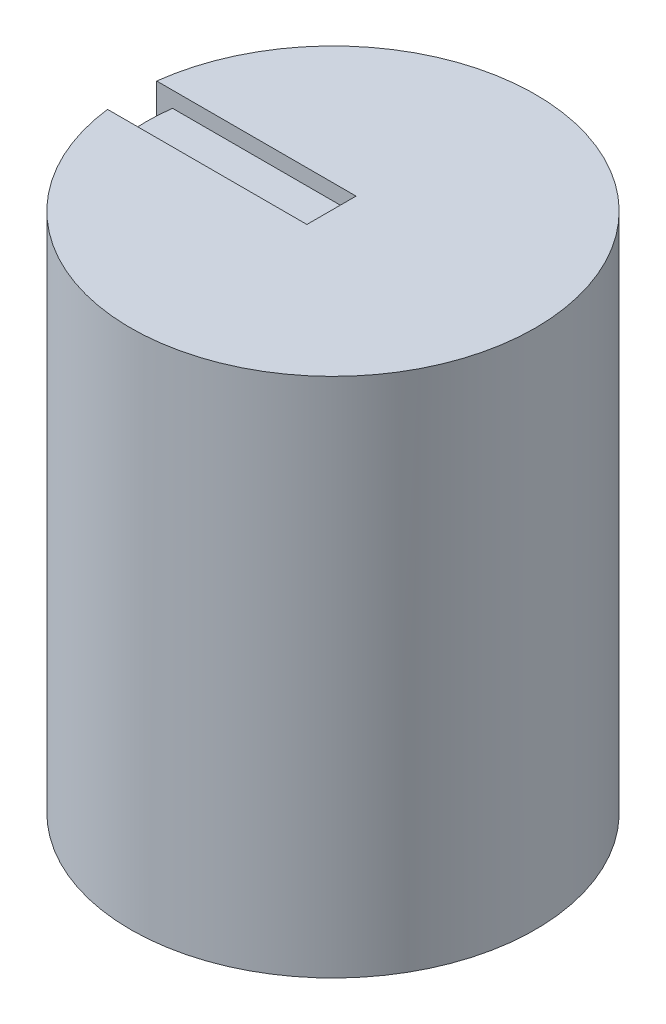
ISO-10303-21;
HEADER;
FILE_DESCRIPTION(('STEP AP214'),'2;1');
FILE_NAME('part.step','',(''),(''),'','','');
FILE_SCHEMA(('AUTOMOTIVE_DESIGN { 1 0 10303 214 1 1 1 1 }'));
ENDSEC;
DATA;
#1=APPLICATION_CONTEXT('core data for automotive mechanical design processes');
#2=APPLICATION_PROTOCOL_DEFINITION('international standard','automotive_design',2000,#1);
#3=PRODUCT_CONTEXT('',#1,'mechanical');
#4=PRODUCT('Part','Part','',(#3));
#5=PRODUCT_RELATED_PRODUCT_CATEGORY('part','',(#4));
#6=PRODUCT_DEFINITION_FORMATION('','',#4);
#7=PRODUCT_DEFINITION_CONTEXT('part definition',#1,'design');
#8=PRODUCT_DEFINITION('design','',#6,#7);
#9=PRODUCT_DEFINITION_SHAPE('','',#8);
#10=(LENGTH_UNIT() NAMED_UNIT(*) SI_UNIT(.MILLI.,.METRE.));
#11=(NAMED_UNIT(*) PLANE_ANGLE_UNIT() SI_UNIT($,.RADIAN.));
#12=(NAMED_UNIT(*) SI_UNIT($,.STERADIAN.) SOLID_ANGLE_UNIT());
#13=UNCERTAINTY_MEASURE_WITH_UNIT(LENGTH_MEASURE(1.E-05),#10,'distance_accuracy_value','');
#14=(GEOMETRIC_REPRESENTATION_CONTEXT(3) GLOBAL_UNCERTAINTY_ASSIGNED_CONTEXT((#13)) GLOBAL_UNIT_ASSIGNED_CONTEXT((#10,
#11,#12)) REPRESENTATION_CONTEXT('',''));
#15=CARTESIAN_POINT('',(0.,0.,0.));
#16=DIRECTION('',(0.,0.,1.));
#17=DIRECTION('',(1.,0.,0.));
#18=AXIS2_PLACEMENT_3D('',#15,#16,#17);
#19=CARTESIAN_POINT('',(0.,16.3322,0.));
#20=DIRECTION('',(0.,1.,0.));
#21=DIRECTION('',(0.,0.,1.));
#22=AXIS2_PLACEMENT_3D('',#19,#20,#21);
#23=PLANE('',#22);
#24=CARTESIAN_POINT('',(0.,16.3322,0.));
#25=DIRECTION('',(0.,-1.,0.));
#26=DIRECTION('',(0.,0.,-1.));
#27=AXIS2_PLACEMENT_3D('',#24,#25,#26);
#28=CIRCLE('',#27,6.0325);
#29=CARTESIAN_POINT('',(-5.98001434417332,16.3322,-0.79403066280931));
#30=VERTEX_POINT('',#29);
#31=CARTESIAN_POINT('',(-5.98001434417332,16.3322,0.794030662809315));
#32=VERTEX_POINT('',#31);
#33=EDGE_CURVE('E120',#30,#32,#28,.F.);
#34=ORIENTED_EDGE('',*,*,#33,.T.);
#35=DIRECTION('',(-1.,0.,0.));
#36=VECTOR('',#35,1.);
#37=CARTESIAN_POINT('',(0.,16.3322,0.794030662809315));
#38=LINE('',#37,#36);
#39=CARTESIAN_POINT('',(-0.0492896040025954,16.3322,0.794030662809315));
#40=VERTEX_POINT('',#39);
#41=EDGE_CURVE('E130',#40,#32,#38,.T.);
#42=ORIENTED_EDGE('',*,*,#41,.F.);
#43=DIRECTION('',(0.,0.,1.));
#44=VECTOR('',#43,1.);
#45=CARTESIAN_POINT('',(-0.0492896040025954,16.3322,0.));
#46=LINE('',#45,#44);
#47=CARTESIAN_POINT('',(-0.0492896040025954,16.3322,-0.79403066280931));
#48=VERTEX_POINT('',#47);
#49=EDGE_CURVE('E137',#48,#40,#46,.T.);
#50=ORIENTED_EDGE('',*,*,#49,.F.);
#51=DIRECTION('',(1.,0.,0.));
#52=VECTOR('',#51,1.);
#53=CARTESIAN_POINT('',(0.,16.3322,-0.79403066280931));
#54=LINE('',#53,#52);
#55=EDGE_CURVE('E131',#30,#48,#54,.T.);
#56=ORIENTED_EDGE('',*,*,#55,.F.);
#57=EDGE_LOOP('',(#34,#42,#50,#56));
#58=FACE_BOUND('',#57,.T.);
#59=ADVANCED_FACE('F37',(#58),#23,.T.);
#60=CARTESIAN_POINT('',(0.,12.573,0.));
#61=DIRECTION('',(0.,-1.,0.));
#62=DIRECTION('',(0.,0.,-1.));
#63=AXIS2_PLACEMENT_3D('',#60,#61,#62);
#64=CYLINDRICAL_SURFACE('',#63,6.5405);
#65=CARTESIAN_POINT('',(0.,29.045499725639,0.));
#66=DIRECTION('',(-0.610334521541643,0.190808995376545,-0.768819679182269));
#67=DIRECTION('',(-0.118637012974686,-0.981627183447664,-0.149443406910611));
#68=AXIS2_PLACEMENT_3D('',#65,#66,#67);
#69=ELLIPSE('',#68,34.2777340611898,6.5405);
#70=CARTESIAN_POINT('',(-6.09641178407993,0.,-2.36894567454204));
#71=VERTEX_POINT('',#70);
#72=CARTESIAN_POINT('',(-6.49212257713289,5.08,-0.794030662809312));
#73=VERTEX_POINT('',#72);
#74=EDGE_CURVE('E173',#71,#73,#69,.T.);
#75=ORIENTED_EDGE('',*,*,#74,.T.);
#76=DIRECTION('',(0.,1.,0.));
#77=VECTOR('',#76,1.);
#78=CARTESIAN_POINT('',(-6.49212257713289,16.3322,-0.79403066280931));
#79=LINE('',#78,#77);
#80=CARTESIAN_POINT('',(-6.49212257713289,16.8402,-0.79403066280931));
#81=VERTEX_POINT('',#80);
#82=EDGE_CURVE('E151',#73,#81,#79,.T.);
#83=ORIENTED_EDGE('',*,*,#82,.T.);
#84=CARTESIAN_POINT('',(0.,16.8402,0.));
#85=DIRECTION('',(0.,1.,0.));
#86=DIRECTION('',(0.,0.,1.));
#87=AXIS2_PLACEMENT_3D('',#84,#85,#86);
#88=CIRCLE('',#87,6.5405);
#89=CARTESIAN_POINT('',(-6.49212257713289,16.8402,0.794030662809314));
#90=VERTEX_POINT('',#89);
#91=EDGE_CURVE('E175',#90,#81,#88,.T.);
#92=ORIENTED_EDGE('',*,*,#91,.F.);
#93=DIRECTION('',(0.,1.,0.));
#94=VECTOR('',#93,1.);
#95=CARTESIAN_POINT('',(-6.49212257713289,16.3322,0.794030662809314));
#96=LINE('',#95,#94);
#97=CARTESIAN_POINT('',(-6.49212257713289,5.08,0.794030662809313));
#98=VERTEX_POINT('',#97);
#99=EDGE_CURVE('E52',#98,#90,#96,.T.);
#100=ORIENTED_EDGE('',*,*,#99,.F.);
#101=CARTESIAN_POINT('',(0.,29.045499725639,0.));
#102=DIRECTION('',(-0.610334521541643,0.190808995376545,0.768819679182269));
#103=DIRECTION('',(-0.118637012974686,-0.981627183447664,0.149443406910611));
#104=AXIS2_PLACEMENT_3D('',#101,#102,#103);
#105=ELLIPSE('',#104,34.2777340611898,6.5405);
#106=CARTESIAN_POINT('',(-6.09641178407993,0.,2.36894567454204));
#107=VERTEX_POINT('',#106);
#108=EDGE_CURVE('E167',#107,#98,#105,.F.);
#109=ORIENTED_EDGE('',*,*,#108,.F.);
#110=CARTESIAN_POINT('',(0.,0.,0.));
#111=DIRECTION('',(0.,1.,0.));
#112=DIRECTION('',(0.,0.,1.));
#113=AXIS2_PLACEMENT_3D('',#110,#111,#112);
#114=CIRCLE('',#113,6.5405);
#115=EDGE_CURVE('E60',#107,#71,#114,.T.);
#116=ORIENTED_EDGE('',*,*,#115,.T.);
#117=EDGE_LOOP('',(#75,#83,#92,#100,#109,#116));
#118=FACE_BOUND('',#117,.T.);
#119=ADVANCED_FACE('F215',(#118),#64,.T.);
#120=CARTESIAN_POINT('',(0.,16.8402,0.));
#121=DIRECTION('',(0.,1.,0.));
#122=DIRECTION('',(0.,0.,1.));
#123=AXIS2_PLACEMENT_3D('',#120,#121,#122);
#124=PLANE('',#123);
#125=ORIENTED_EDGE('',*,*,#91,.T.);
#126=DIRECTION('',(1.,0.,0.));
#127=VECTOR('',#126,1.);
#128=CARTESIAN_POINT('',(0.,16.8402,-0.79403066280931));
#129=LINE('',#128,#127);
#130=CARTESIAN_POINT('',(-0.0492896040025954,16.8402,-0.79403066280931));
#131=VERTEX_POINT('',#130);
#132=EDGE_CURVE('E138',#81,#131,#129,.T.);
#133=ORIENTED_EDGE('',*,*,#132,.T.);
#134=DIRECTION('',(0.,0.,1.));
#135=VECTOR('',#134,1.);
#136=CARTESIAN_POINT('',(-0.0492896040025954,16.8402,0.));
#137=LINE('',#136,#135);
#138=CARTESIAN_POINT('',(-0.0492896040025954,16.8402,0.794030662809315));
#139=VERTEX_POINT('',#138);
#140=EDGE_CURVE('E142',#131,#139,#137,.T.);
#141=ORIENTED_EDGE('',*,*,#140,.T.);
#142=DIRECTION('',(-1.,0.,0.));
#143=VECTOR('',#142,1.);
#144=CARTESIAN_POINT('',(0.,16.8402,0.794030662809315));
#145=LINE('',#144,#143);
#146=EDGE_CURVE('E132',#139,#90,#145,.T.);
#147=ORIENTED_EDGE('',*,*,#146,.T.);
#148=EDGE_LOOP('',(#125,#133,#141,#147));
#149=FACE_BOUND('',#148,.T.);
#150=ADVANCED_FACE('F220',(#149),#124,.T.);
#151=CARTESIAN_POINT('',(0.,12.573,0.8001));
#152=DIRECTION('',(0.,0.,1.));
#153=DIRECTION('',(1.,0.,0.));
#154=AXIS2_PLACEMENT_3D('',#151,#152,#153);
#155=PLANE('',#154);
#156=DIRECTION('',(-1.,0.,0.));
#157=VECTOR('',#156,1.);
#158=CARTESIAN_POINT('',(0.,0.,0.8001));
#159=LINE('',#158,#157);
#160=CARTESIAN_POINT('',(1.3711295489486,0.,0.8001));
#161=VERTEX_POINT('',#160);
#162=CARTESIAN_POINT('',(-1.3711295489486,0.,0.8001));
#163=VERTEX_POINT('',#162);
#164=EDGE_CURVE('E178',#161,#163,#159,.T.);
#165=ORIENTED_EDGE('',*,*,#164,.T.);
#166=DIRECTION('',(0.,-1.,0.));
#167=VECTOR('',#166,1.);
#168=CARTESIAN_POINT('',(-1.3711295489486,12.573,0.8001));
#169=LINE('',#168,#167);
#170=CARTESIAN_POINT('',(-1.3711295489486,12.573,0.8001));
#171=VERTEX_POINT('',#170);
#172=EDGE_CURVE('E12',#171,#163,#169,.T.);
#173=ORIENTED_EDGE('',*,*,#172,.F.);
#174=DIRECTION('',(-1.,0.,0.));
#175=VECTOR('',#174,1.);
#176=CARTESIAN_POINT('',(0.,12.573,0.8001));
#177=LINE('',#176,#175);
#178=CARTESIAN_POINT('',(1.3711295489486,12.573,0.8001));
#179=VERTEX_POINT('',#178);
#180=EDGE_CURVE('E179',#179,#171,#177,.T.);
#181=ORIENTED_EDGE('',*,*,#180,.F.);
#182=DIRECTION('',(0.,-1.,0.));
#183=VECTOR('',#182,1.);
#184=CARTESIAN_POINT('',(1.3711295489486,12.573,0.8001));
#185=LINE('',#184,#183);
#186=EDGE_CURVE('E45',#179,#161,#185,.T.);
#187=ORIENTED_EDGE('',*,*,#186,.T.);
#188=EDGE_LOOP('',(#165,#173,#181,#187));
#189=FACE_BOUND('',#188,.T.);
#190=ADVANCED_FACE('F39',(#189),#155,.F.);
#191=CARTESIAN_POINT('',(0.,12.573,0.));
#192=DIRECTION('',(0.,-1.,0.));
#193=DIRECTION('',(0.,0.,-1.));
#194=AXIS2_PLACEMENT_3D('',#191,#192,#193);
#195=CYLINDRICAL_SURFACE('',#194,1.5875);
#196=CARTESIAN_POINT('',(0.,0.,0.));
#197=DIRECTION('',(0.,1.,0.));
#198=DIRECTION('',(0.,0.,1.));
#199=AXIS2_PLACEMENT_3D('',#196,#197,#198);
#200=CIRCLE('',#199,1.5875);
#201=EDGE_CURVE('E186',#161,#163,#200,.T.);
#202=ORIENTED_EDGE('',*,*,#201,.F.);
#203=ORIENTED_EDGE('',*,*,#186,.F.);
#204=CARTESIAN_POINT('',(0.,12.573,0.));
#205=DIRECTION('',(0.,1.,0.));
#206=DIRECTION('',(0.,0.,1.));
#207=AXIS2_PLACEMENT_3D('',#204,#205,#206);
#208=CIRCLE('',#207,1.5875);
#209=EDGE_CURVE('E181',#179,#171,#208,.T.);
#210=ORIENTED_EDGE('',*,*,#209,.T.);
#211=ORIENTED_EDGE('',*,*,#172,.T.);
#212=EDGE_LOOP('',(#202,#203,#210,#211));
#213=FACE_BOUND('',#212,.T.);
#214=ADVANCED_FACE('F198',(#213),#195,.F.);
#215=CARTESIAN_POINT('',(0.,0.,0.));
#216=DIRECTION('',(0.,1.,0.));
#217=DIRECTION('',(0.,0.,1.));
#218=AXIS2_PLACEMENT_3D('',#215,#216,#217);
#219=PLANE('',#218);
#220=ORIENTED_EDGE('',*,*,#115,.F.);
#221=DIRECTION('',(0.78320944259309,0.,0.621757966601975));
#222=VECTOR('',#221,1.);
#223=CARTESIAN_POINT('',(-3.51036665030436,0.,4.42190121424255));
#224=LINE('',#223,#222);
#225=CARTESIAN_POINT('',(-9.0805,0.,0.));
#226=VERTEX_POINT('',#225);
#227=EDGE_CURVE('E154',#226,#107,#224,.T.);
#228=ORIENTED_EDGE('',*,*,#227,.F.);
#229=DIRECTION('',(0.78320944259309,0.,-0.621757966601975));
#230=VECTOR('',#229,1.);
#231=CARTESIAN_POINT('',(-3.51036665030436,0.,-4.42190121424254));
#232=LINE('',#231,#230);
#233=EDGE_CURVE('E161',#226,#71,#232,.T.);
#234=ORIENTED_EDGE('',*,*,#233,.T.);
#235=EDGE_LOOP('',(#220,#228,#234));
#236=FACE_BOUND('',#235,.T.);
#237=ORIENTED_EDGE('',*,*,#164,.F.);
#238=ORIENTED_EDGE('',*,*,#201,.T.);
#239=EDGE_LOOP('',(#237,#238));
#240=FACE_BOUND('',#239,.T.);
#241=ADVANCED_FACE('F197',(#236,#240),#219,.F.);
#242=CARTESIAN_POINT('',(0.,12.573,0.));
#243=DIRECTION('',(0.,1.,0.));
#244=DIRECTION('',(0.,0.,1.));
#245=AXIS2_PLACEMENT_3D('',#242,#243,#244);
#246=PLANE('',#245);
#247=ORIENTED_EDGE('',*,*,#209,.F.);
#248=ORIENTED_EDGE('',*,*,#180,.T.);
#249=EDGE_LOOP('',(#247,#248));
#250=FACE_BOUND('',#249,.T.);
#251=ADVANCED_FACE('F200',(#250),#246,.F.);
#252=CARTESIAN_POINT('',(-3.51036665030436,0.,-4.42190121424254));
#253=DIRECTION('',(-0.610334521541643,0.190808995376545,-0.768819679182269));
#254=DIRECTION('',(-0.783209442593089,0.,0.621757966601974));
#255=AXIS2_PLACEMENT_3D('',#252,#253,#254);
#256=PLANE('',#255);
#257=ORIENTED_EDGE('',*,*,#74,.F.);
#258=ORIENTED_EDGE('',*,*,#233,.F.);
#259=DIRECTION('',(0.298388192166378,0.954444595969656,0.));
#260=VECTOR('',#259,1.);
#261=CARTESIAN_POINT('',(-8.58456031848195,1.5863461134812,0.));
#262=LINE('',#261,#260);
#263=CARTESIAN_POINT('',(-7.49233865191753,5.08,0.));
#264=VERTEX_POINT('',#263);
#265=EDGE_CURVE('E165',#264,#226,#262,.F.);
#266=ORIENTED_EDGE('',*,*,#265,.F.);
#267=DIRECTION('',(0.783209442593089,0.,-0.621757966601974));
#268=VECTOR('',#267,1.);
#269=CARTESIAN_POINT('',(-2.89641052105915,5.08,-3.64851950690275));
#270=LINE('',#269,#268);
#271=EDGE_CURVE('E168',#264,#73,#270,.T.);
#272=ORIENTED_EDGE('',*,*,#271,.T.);
#273=EDGE_LOOP('',(#257,#258,#266,#272));
#274=FACE_BOUND('',#273,.T.);
#275=ADVANCED_FACE('F202',(#274),#256,.T.);
#276=CARTESIAN_POINT('',(-3.51036665030436,0.,4.42190121424255));
#277=DIRECTION('',(-0.610334521541643,0.190808995376545,0.768819679182269));
#278=DIRECTION('',(0.783209442593089,0.,0.621757966601975));
#279=AXIS2_PLACEMENT_3D('',#276,#277,#278);
#280=PLANE('',#279);
#281=ORIENTED_EDGE('',*,*,#227,.T.);
#282=ORIENTED_EDGE('',*,*,#108,.T.);
#283=DIRECTION('',(-0.783209442593089,0.,-0.621757966601975));
#284=VECTOR('',#283,1.);
#285=CARTESIAN_POINT('',(-2.89641052105915,5.08,3.64851950690276));
#286=LINE('',#285,#284);
#287=EDGE_CURVE('E164',#264,#98,#286,.F.);
#288=ORIENTED_EDGE('',*,*,#287,.F.);
#289=ORIENTED_EDGE('',*,*,#265,.T.);
#290=EDGE_LOOP('',(#281,#282,#288,#289));
#291=FACE_BOUND('',#290,.T.);
#292=ADVANCED_FACE('F208',(#291),#280,.T.);
#293=CARTESIAN_POINT('',(0.,5.08,0.));
#294=DIRECTION('',(0.,-1.,0.));
#295=DIRECTION('',(0.,0.,-1.));
#296=AXIS2_PLACEMENT_3D('',#293,#294,#295);
#297=PLANE('',#296);
#298=ORIENTED_EDGE('',*,*,#287,.T.);
#299=DIRECTION('',(-1.,0.,0.));
#300=VECTOR('',#299,1.);
#301=CARTESIAN_POINT('',(7.5575,5.08,0.794030662809313));
#302=LINE('',#301,#300);
#303=CARTESIAN_POINT('',(-5.98001434417332,5.08,0.794030662809315));
#304=VERTEX_POINT('',#303);
#305=EDGE_CURVE('E251',#304,#98,#302,.T.);
#306=ORIENTED_EDGE('',*,*,#305,.F.);
#307=CARTESIAN_POINT('',(0.,5.08,0.));
#308=DIRECTION('',(0.,1.,0.));
#309=DIRECTION('',(0.,0.,1.));
#310=AXIS2_PLACEMENT_3D('',#307,#308,#309);
#311=CIRCLE('',#310,6.0325);
#312=CARTESIAN_POINT('',(-5.98001434417332,5.08,-0.794030662809311));
#313=VERTEX_POINT('',#312);
#314=EDGE_CURVE('E122',#304,#313,#311,.F.);
#315=ORIENTED_EDGE('',*,*,#314,.T.);
#316=DIRECTION('',(-1.,0.,0.));
#317=VECTOR('',#316,1.);
#318=CARTESIAN_POINT('',(7.5575,5.08,-0.794030662809312));
#319=LINE('',#318,#317);
#320=EDGE_CURVE('E125',#313,#73,#319,.T.);
#321=ORIENTED_EDGE('',*,*,#320,.T.);
#322=ORIENTED_EDGE('',*,*,#271,.F.);
#323=EDGE_LOOP('',(#298,#306,#315,#321,#322));
#324=FACE_BOUND('',#323,.T.);
#325=ADVANCED_FACE('F228',(#324),#297,.F.);
#326=CARTESIAN_POINT('',(0.,16.3322,-0.79403066280931));
#327=DIRECTION('',(0.,0.,1.));
#328=DIRECTION('',(1.,0.,0.));
#329=AXIS2_PLACEMENT_3D('',#326,#327,#328);
#330=PLANE('',#329);
#331=ORIENTED_EDGE('',*,*,#132,.F.);
#332=ORIENTED_EDGE('',*,*,#82,.F.);
#333=ORIENTED_EDGE('',*,*,#320,.F.);
#334=DIRECTION('',(0.,-1.,0.));
#335=VECTOR('',#334,1.);
#336=CARTESIAN_POINT('',(-5.98001434417332,12.573,-0.794030662809311));
#337=LINE('',#336,#335);
#338=EDGE_CURVE('E250',#30,#313,#337,.T.);
#339=ORIENTED_EDGE('',*,*,#338,.F.);
#340=ORIENTED_EDGE('',*,*,#55,.T.);
#341=DIRECTION('',(0.,1.,0.));
#342=VECTOR('',#341,1.);
#343=CARTESIAN_POINT('',(-0.0492896040025954,16.3322,-0.79403066280931));
#344=LINE('',#343,#342);
#345=EDGE_CURVE('E155',#48,#131,#344,.T.);
#346=ORIENTED_EDGE('',*,*,#345,.T.);
#347=EDGE_LOOP('',(#331,#332,#333,#339,#340,#346));
#348=FACE_BOUND('',#347,.T.);
#349=ADVANCED_FACE('F224',(#348),#330,.T.);
#350=CARTESIAN_POINT('',(-0.0492896040025954,16.3322,0.));
#351=DIRECTION('',(-1.,0.,0.));
#352=DIRECTION('',(0.,0.,1.));
#353=AXIS2_PLACEMENT_3D('',#350,#351,#352);
#354=PLANE('',#353);
#355=ORIENTED_EDGE('',*,*,#140,.F.);
#356=ORIENTED_EDGE('',*,*,#345,.F.);
#357=ORIENTED_EDGE('',*,*,#49,.T.);
#358=DIRECTION('',(0.,1.,0.));
#359=VECTOR('',#358,1.);
#360=CARTESIAN_POINT('',(-0.0492896040025954,16.3322,0.794030662809315));
#361=LINE('',#360,#359);
#362=EDGE_CURVE('E136',#40,#139,#361,.T.);
#363=ORIENTED_EDGE('',*,*,#362,.T.);
#364=EDGE_LOOP('',(#355,#356,#357,#363));
#365=FACE_BOUND('',#364,.T.);
#366=ADVANCED_FACE('F227',(#365),#354,.T.);
#367=CARTESIAN_POINT('',(0.,16.3322,0.794030662809315));
#368=DIRECTION('',(0.,0.,-1.));
#369=DIRECTION('',(-1.,0.,0.));
#370=AXIS2_PLACEMENT_3D('',#367,#368,#369);
#371=PLANE('',#370);
#372=ORIENTED_EDGE('',*,*,#146,.F.);
#373=ORIENTED_EDGE('',*,*,#362,.F.);
#374=ORIENTED_EDGE('',*,*,#41,.T.);
#375=DIRECTION('',(0.,-1.,0.));
#376=VECTOR('',#375,1.);
#377=CARTESIAN_POINT('',(-5.98001434417332,12.573,0.794030662809315));
#378=LINE('',#377,#376);
#379=EDGE_CURVE('E116',#304,#32,#378,.F.);
#380=ORIENTED_EDGE('',*,*,#379,.F.);
#381=ORIENTED_EDGE('',*,*,#305,.T.);
#382=ORIENTED_EDGE('',*,*,#99,.T.);
#383=EDGE_LOOP('',(#372,#373,#374,#380,#381,#382));
#384=FACE_BOUND('',#383,.T.);
#385=ADVANCED_FACE('F135',(#384),#371,.T.);
#386=CARTESIAN_POINT('',(0.,12.573,0.));
#387=DIRECTION('',(0.,-1.,0.));
#388=DIRECTION('',(0.,0.,-1.));
#389=AXIS2_PLACEMENT_3D('',#386,#387,#388);
#390=CYLINDRICAL_SURFACE('',#389,6.0325);
#391=ORIENTED_EDGE('',*,*,#379,.T.);
#392=ORIENTED_EDGE('',*,*,#33,.F.);
#393=ORIENTED_EDGE('',*,*,#338,.T.);
#394=ORIENTED_EDGE('',*,*,#314,.F.);
#395=EDGE_LOOP('',(#391,#392,#393,#394));
#396=FACE_BOUND('',#395,.T.);
#397=ADVANCED_FACE('F118',(#396),#390,.T.);
#398=CLOSED_SHELL('',(#59,#119,#150,#190,#214,#241,#251,#275,#292,#325,#349,#366,#385,#397));
#399=MANIFOLD_SOLID_BREP('B2',#398);
#400=ADVANCED_BREP_SHAPE_REPRESENTATION('',(#18,#399),#14);
#401=SHAPE_DEFINITION_REPRESENTATION(#9,#400);
ENDSEC;
END-ISO-10303-21;
